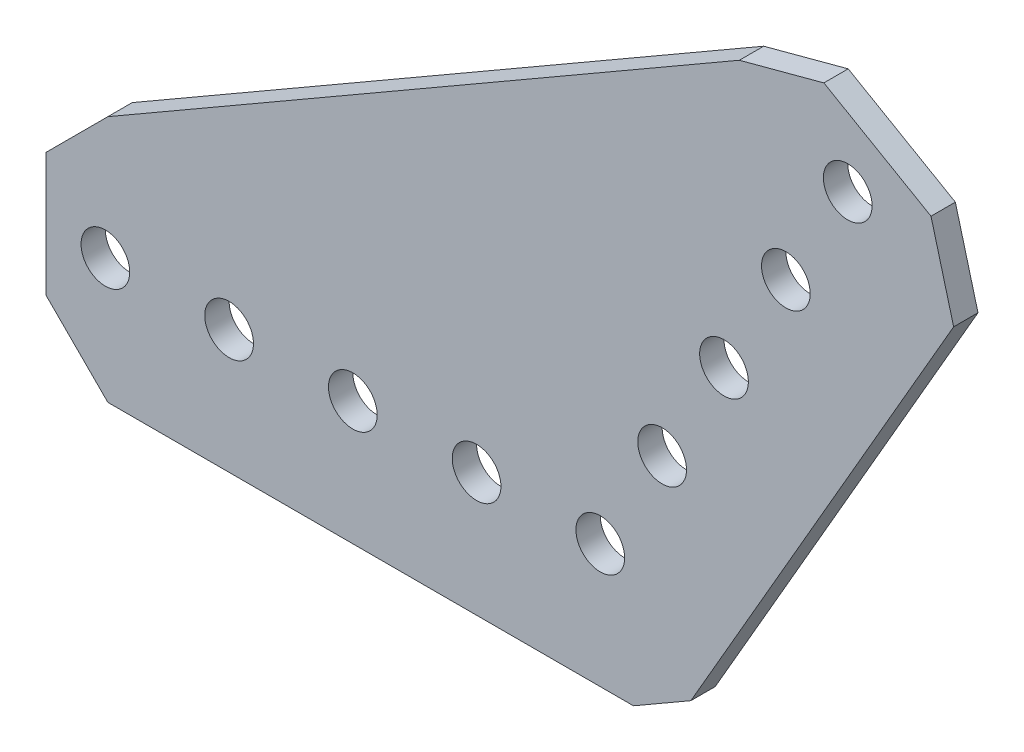
ISO-10303-21;
HEADER;
FILE_DESCRIPTION(('STEP AP214'),'2;1');
FILE_NAME('part.step','',(''),(''),'','','');
FILE_SCHEMA(('AUTOMOTIVE_DESIGN { 1 0 10303 214 1 1 1 1 }'));
ENDSEC;
DATA;
#1=APPLICATION_CONTEXT('core data for automotive mechanical design processes');
#2=APPLICATION_PROTOCOL_DEFINITION('international standard','automotive_design',2000,#1);
#3=PRODUCT_CONTEXT('',#1,'mechanical');
#4=PRODUCT('Part','Part','',(#3));
#5=PRODUCT_RELATED_PRODUCT_CATEGORY('part','',(#4));
#6=PRODUCT_DEFINITION_FORMATION('','',#4);
#7=PRODUCT_DEFINITION_CONTEXT('part definition',#1,'design');
#8=PRODUCT_DEFINITION('design','',#6,#7);
#9=PRODUCT_DEFINITION_SHAPE('','',#8);
#10=(LENGTH_UNIT() NAMED_UNIT(*) SI_UNIT(.MILLI.,.METRE.));
#11=(NAMED_UNIT(*) PLANE_ANGLE_UNIT() SI_UNIT($,.RADIAN.));
#12=(NAMED_UNIT(*) SI_UNIT($,.STERADIAN.) SOLID_ANGLE_UNIT());
#13=UNCERTAINTY_MEASURE_WITH_UNIT(LENGTH_MEASURE(1.E-05),#10,'distance_accuracy_value','');
#14=(GEOMETRIC_REPRESENTATION_CONTEXT(3) GLOBAL_UNCERTAINTY_ASSIGNED_CONTEXT((#13)) GLOBAL_UNIT_ASSIGNED_CONTEXT((#10,
#11,#12)) REPRESENTATION_CONTEXT('',''));
#15=CARTESIAN_POINT('',(0.,0.,0.));
#16=DIRECTION('',(0.,0.,1.));
#17=DIRECTION('',(1.,0.,0.));
#18=AXIS2_PLACEMENT_3D('',#15,#16,#17);
#19=CARTESIAN_POINT('',(9.29704525612477,-9.29704525612472,1.25));
#20=DIRECTION('',(0.500000000000001,-0.866025403784438,0.));
#21=DIRECTION('',(0.866025403784438,0.500000000000001,0.));
#22=AXIS2_PLACEMENT_3D('',#19,#20,#21);
#23=PLANE('',#22);
#24=DIRECTION('',(-0.866025403784438,-0.500000000000001,0.));
#25=VECTOR('',#24,1.);
#26=CARTESIAN_POINT('',(9.29704525612477,-9.29704525612472,-1.25));
#27=LINE('',#26,#25);
#28=CARTESIAN_POINT('',(9.29704525612477,-9.29704525612472,-1.25));
#29=VERTEX_POINT('',#28);
#30=CARTESIAN_POINT('',(3.40295474387527,-12.7,-1.25));
#31=VERTEX_POINT('',#30);
#32=EDGE_CURVE('E160',#29,#31,#27,.T.);
#33=ORIENTED_EDGE('',*,*,#32,.F.);
#34=DIRECTION('',(0.,0.,-1.));
#35=VECTOR('',#34,1.);
#36=CARTESIAN_POINT('',(9.29704525612477,-9.29704525612472,1.25));
#37=LINE('',#36,#35);
#38=CARTESIAN_POINT('',(9.29704525612477,-9.29704525612472,1.25));
#39=VERTEX_POINT('',#38);
#40=EDGE_CURVE('E11',#39,#29,#37,.T.);
#41=ORIENTED_EDGE('',*,*,#40,.F.);
#42=DIRECTION('',(-0.866025403784438,-0.500000000000001,0.));
#43=VECTOR('',#42,1.);
#44=CARTESIAN_POINT('',(9.29704525612477,-9.29704525612472,1.25));
#45=LINE('',#44,#43);
#46=CARTESIAN_POINT('',(3.40295474387527,-12.7,1.25));
#47=VERTEX_POINT('',#46);
#48=EDGE_CURVE('E197',#39,#47,#45,.T.);
#49=ORIENTED_EDGE('',*,*,#48,.T.);
#50=DIRECTION('',(0.,0.,-1.));
#51=VECTOR('',#50,1.);
#52=CARTESIAN_POINT('',(3.40295474387527,-12.7,1.25));
#53=LINE('',#52,#51);
#54=EDGE_CURVE('E48',#47,#31,#53,.T.);
#55=ORIENTED_EDGE('',*,*,#54,.T.);
#56=EDGE_LOOP('',(#33,#41,#49,#55));
#57=FACE_BOUND('',#56,.T.);
#58=ADVANCED_FACE('F45',(#57),#23,.T.);
#59=CARTESIAN_POINT('',(36.2715226280623,37.4241200596883,1.25));
#60=DIRECTION('',(0.86602540378444,-0.499999999999998,0.));
#61=DIRECTION('',(0.499999999999998,0.86602540378444,0.));
#62=AXIS2_PLACEMENT_3D('',#59,#60,#61);
#63=PLANE('',#62);
#64=DIRECTION('',(-0.499999999999998,-0.86602540378444,0.));
#65=VECTOR('',#64,1.);
#66=CARTESIAN_POINT('',(36.2715226280623,37.4241200596883,-1.25));
#67=LINE('',#66,#65);
#68=CARTESIAN_POINT('',(36.2715226280623,37.4241200596883,-1.25));
#69=VERTEX_POINT('',#68);
#70=EDGE_CURVE('E194',#69,#29,#67,.T.);
#71=ORIENTED_EDGE('',*,*,#70,.F.);
#72=DIRECTION('',(0.,0.,-1.));
#73=VECTOR('',#72,1.);
#74=CARTESIAN_POINT('',(36.2715226280623,37.4241200596883,1.25));
#75=LINE('',#74,#73);
#76=CARTESIAN_POINT('',(36.2715226280623,37.4241200596883,1.25));
#77=VERTEX_POINT('',#76);
#78=EDGE_CURVE('E55',#77,#69,#75,.T.);
#79=ORIENTED_EDGE('',*,*,#78,.F.);
#80=DIRECTION('',(-0.499999999999998,-0.86602540378444,0.));
#81=VECTOR('',#80,1.);
#82=CARTESIAN_POINT('',(36.2715226280623,37.4241200596883,1.25));
#83=LINE('',#82,#81);
#84=EDGE_CURVE('E146',#77,#39,#83,.T.);
#85=ORIENTED_EDGE('',*,*,#84,.T.);
#86=ORIENTED_EDGE('',*,*,#40,.T.);
#87=EDGE_LOOP('',(#71,#79,#85,#86));
#88=FACE_BOUND('',#87,.T.);
#89=ADVANCED_FACE('F221',(#88),#63,.T.);
#90=CARTESIAN_POINT('',(33.9472613140311,46.0983813737195,1.25));
#91=DIRECTION('',(0.965925826289068,0.258819045102522,0.));
#92=DIRECTION('',(-0.258819045102522,0.965925826289068,0.));
#93=AXIS2_PLACEMENT_3D('',#90,#91,#92);
#94=PLANE('',#93);
#95=DIRECTION('',(0.258819045102522,-0.965925826289068,0.));
#96=VECTOR('',#95,1.);
#97=CARTESIAN_POINT('',(33.9472613140311,46.0983813737195,-1.25));
#98=LINE('',#97,#96);
#99=CARTESIAN_POINT('',(33.9472613140311,46.0983813737195,-1.25));
#100=VERTEX_POINT('',#99);
#101=EDGE_CURVE('E132',#100,#69,#98,.T.);
#102=ORIENTED_EDGE('',*,*,#101,.F.);
#103=DIRECTION('',(0.,0.,-1.));
#104=VECTOR('',#103,1.);
#105=CARTESIAN_POINT('',(33.9472613140311,46.0983813737195,1.25));
#106=LINE('',#105,#104);
#107=CARTESIAN_POINT('',(33.9472613140311,46.0983813737195,1.25));
#108=VERTEX_POINT('',#107);
#109=EDGE_CURVE('E127',#108,#100,#106,.T.);
#110=ORIENTED_EDGE('',*,*,#109,.F.);
#111=DIRECTION('',(0.258819045102522,-0.965925826289068,0.));
#112=VECTOR('',#111,1.);
#113=CARTESIAN_POINT('',(33.9472613140311,46.0983813737195,1.25));
#114=LINE('',#113,#112);
#115=EDGE_CURVE('E130',#108,#77,#114,.T.);
#116=ORIENTED_EDGE('',*,*,#115,.T.);
#117=ORIENTED_EDGE('',*,*,#78,.T.);
#118=EDGE_LOOP('',(#102,#110,#116,#117));
#119=FACE_BOUND('',#118,.T.);
#120=ADVANCED_FACE('F129',(#119),#94,.T.);
#121=CARTESIAN_POINT('',(22.9487386859687,52.4483813737195,1.25));
#122=DIRECTION('',(0.500000000000001,0.866025403784438,0.));
#123=DIRECTION('',(-0.866025403784438,0.500000000000001,0.));
#124=AXIS2_PLACEMENT_3D('',#121,#122,#123);
#125=PLANE('',#124);
#126=DIRECTION('',(0.866025403784438,-0.500000000000001,0.));
#127=VECTOR('',#126,1.);
#128=CARTESIAN_POINT('',(22.9487386859687,52.4483813737195,-1.25));
#129=LINE('',#128,#127);
#130=CARTESIAN_POINT('',(22.9487386859687,52.4483813737195,-1.25));
#131=VERTEX_POINT('',#130);
#132=EDGE_CURVE('E189',#131,#100,#129,.T.);
#133=ORIENTED_EDGE('',*,*,#132,.F.);
#134=DIRECTION('',(0.,0.,-1.));
#135=VECTOR('',#134,1.);
#136=CARTESIAN_POINT('',(22.9487386859687,52.4483813737195,1.25));
#137=LINE('',#136,#135);
#138=CARTESIAN_POINT('',(22.9487386859687,52.4483813737195,1.25));
#139=VERTEX_POINT('',#138);
#140=EDGE_CURVE('E138',#139,#131,#137,.T.);
#141=ORIENTED_EDGE('',*,*,#140,.F.);
#142=DIRECTION('',(0.866025403784438,-0.500000000000001,0.));
#143=VECTOR('',#142,1.);
#144=CARTESIAN_POINT('',(22.9487386859687,52.4483813737195,1.25));
#145=LINE('',#144,#143);
#146=EDGE_CURVE('E144',#139,#108,#145,.T.);
#147=ORIENTED_EDGE('',*,*,#146,.T.);
#148=ORIENTED_EDGE('',*,*,#109,.T.);
#149=EDGE_LOOP('',(#133,#141,#147,#148));
#150=FACE_BOUND('',#149,.T.);
#151=ADVANCED_FACE('F149',(#150),#125,.T.);
#152=CARTESIAN_POINT('',(14.2744773719375,50.1241200596883,1.25));
#153=DIRECTION('',(-0.25881904510252,0.965925826289069,0.));
#154=DIRECTION('',(-0.965925826289069,-0.25881904510252,0.));
#155=AXIS2_PLACEMENT_3D('',#152,#153,#154);
#156=PLANE('',#155);
#157=DIRECTION('',(0.965925826289068,0.25881904510252,0.));
#158=VECTOR('',#157,1.);
#159=CARTESIAN_POINT('',(14.2744773719375,50.1241200596883,-1.25));
#160=LINE('',#159,#158);
#161=CARTESIAN_POINT('',(14.2744773719375,50.1241200596883,-1.25));
#162=VERTEX_POINT('',#161);
#163=EDGE_CURVE('E185',#162,#131,#160,.T.);
#164=ORIENTED_EDGE('',*,*,#163,.F.);
#165=DIRECTION('',(0.,0.,-1.));
#166=VECTOR('',#165,1.);
#167=CARTESIAN_POINT('',(14.2744773719375,50.1241200596883,1.25));
#168=LINE('',#167,#166);
#169=CARTESIAN_POINT('',(14.2744773719375,50.1241200596883,1.25));
#170=VERTEX_POINT('',#169);
#171=EDGE_CURVE('E203',#170,#162,#168,.T.);
#172=ORIENTED_EDGE('',*,*,#171,.F.);
#173=DIRECTION('',(0.965925826289068,0.25881904510252,0.));
#174=VECTOR('',#173,1.);
#175=CARTESIAN_POINT('',(14.2744773719375,50.1241200596883,1.25));
#176=LINE('',#175,#174);
#177=EDGE_CURVE('E151',#170,#139,#176,.T.);
#178=ORIENTED_EDGE('',*,*,#177,.T.);
#179=ORIENTED_EDGE('',*,*,#140,.T.);
#180=EDGE_LOOP('',(#164,#172,#178,#179));
#181=FACE_BOUND('',#180,.T.);
#182=ADVANCED_FACE('F234',(#181),#156,.T.);
#183=CARTESIAN_POINT('',(-50.546,12.7,1.25));
#184=DIRECTION('',(-0.500000000000001,0.866025403784438,0.));
#185=DIRECTION('',(-0.866025403784438,-0.500000000000001,0.));
#186=AXIS2_PLACEMENT_3D('',#183,#184,#185);
#187=PLANE('',#186);
#188=DIRECTION('',(0.866025403784438,0.500000000000001,0.));
#189=VECTOR('',#188,1.);
#190=CARTESIAN_POINT('',(-50.546,12.7,-1.25));
#191=LINE('',#190,#189);
#192=CARTESIAN_POINT('',(-50.546,12.7,-1.25));
#193=VERTEX_POINT('',#192);
#194=EDGE_CURVE('E181',#193,#162,#191,.T.);
#195=ORIENTED_EDGE('',*,*,#194,.F.);
#196=DIRECTION('',(0.,0.,-1.));
#197=VECTOR('',#196,1.);
#198=CARTESIAN_POINT('',(-50.546,12.7,1.25));
#199=LINE('',#198,#197);
#200=CARTESIAN_POINT('',(-50.546,12.7,1.25));
#201=VERTEX_POINT('',#200);
#202=EDGE_CURVE('E206',#201,#193,#199,.T.);
#203=ORIENTED_EDGE('',*,*,#202,.F.);
#204=DIRECTION('',(0.866025403784438,0.500000000000001,0.));
#205=VECTOR('',#204,1.);
#206=CARTESIAN_POINT('',(-50.546,12.7,1.25));
#207=LINE('',#206,#205);
#208=EDGE_CURVE('E154',#201,#170,#207,.T.);
#209=ORIENTED_EDGE('',*,*,#208,.T.);
#210=ORIENTED_EDGE('',*,*,#171,.T.);
#211=EDGE_LOOP('',(#195,#203,#209,#210));
#212=FACE_BOUND('',#211,.T.);
#213=ADVANCED_FACE('F237',(#212),#187,.T.);
#214=CARTESIAN_POINT('',(-56.896,6.35,1.25));
#215=DIRECTION('',(-0.707106781186547,0.707106781186548,0.));
#216=DIRECTION('',(-0.707106781186548,-0.707106781186547,0.));
#217=AXIS2_PLACEMENT_3D('',#214,#215,#216);
#218=PLANE('',#217);
#219=DIRECTION('',(0.707106781186548,0.707106781186547,0.));
#220=VECTOR('',#219,1.);
#221=CARTESIAN_POINT('',(-56.896,6.35,-1.25));
#222=LINE('',#221,#220);
#223=CARTESIAN_POINT('',(-56.896,6.35,-1.25));
#224=VERTEX_POINT('',#223);
#225=EDGE_CURVE('E177',#224,#193,#222,.T.);
#226=ORIENTED_EDGE('',*,*,#225,.F.);
#227=DIRECTION('',(0.,0.,-1.));
#228=VECTOR('',#227,1.);
#229=CARTESIAN_POINT('',(-56.896,6.35,1.25));
#230=LINE('',#229,#228);
#231=CARTESIAN_POINT('',(-56.896,6.35,1.25));
#232=VERTEX_POINT('',#231);
#233=EDGE_CURVE('E209',#232,#224,#230,.T.);
#234=ORIENTED_EDGE('',*,*,#233,.F.);
#235=DIRECTION('',(0.707106781186548,0.707106781186547,0.));
#236=VECTOR('',#235,1.);
#237=CARTESIAN_POINT('',(-56.896,6.35,1.25));
#238=LINE('',#237,#236);
#239=EDGE_CURVE('E389',#232,#201,#238,.T.);
#240=ORIENTED_EDGE('',*,*,#239,.T.);
#241=ORIENTED_EDGE('',*,*,#202,.T.);
#242=EDGE_LOOP('',(#226,#234,#240,#241));
#243=FACE_BOUND('',#242,.T.);
#244=ADVANCED_FACE('F241',(#243),#218,.T.);
#245=CARTESIAN_POINT('',(-56.896,-6.35,1.25));
#246=DIRECTION('',(-1.,0.,0.));
#247=DIRECTION('',(0.,0.,1.));
#248=AXIS2_PLACEMENT_3D('',#245,#246,#247);
#249=PLANE('',#248);
#250=DIRECTION('',(0.,1.,0.));
#251=VECTOR('',#250,1.);
#252=CARTESIAN_POINT('',(-56.896,-6.35,-1.25));
#253=LINE('',#252,#251);
#254=CARTESIAN_POINT('',(-56.896,-6.35,-1.25));
#255=VERTEX_POINT('',#254);
#256=EDGE_CURVE('E173',#255,#224,#253,.T.);
#257=ORIENTED_EDGE('',*,*,#256,.F.);
#258=DIRECTION('',(0.,0.,-1.));
#259=VECTOR('',#258,1.);
#260=CARTESIAN_POINT('',(-56.896,-6.35,1.25));
#261=LINE('',#260,#259);
#262=CARTESIAN_POINT('',(-56.896,-6.35,1.25));
#263=VERTEX_POINT('',#262);
#264=EDGE_CURVE('E212',#263,#255,#261,.T.);
#265=ORIENTED_EDGE('',*,*,#264,.F.);
#266=DIRECTION('',(0.,1.,0.));
#267=VECTOR('',#266,1.);
#268=CARTESIAN_POINT('',(-56.896,-6.35,1.25));
#269=LINE('',#268,#267);
#270=EDGE_CURVE('E385',#263,#232,#269,.T.);
#271=ORIENTED_EDGE('',*,*,#270,.T.);
#272=ORIENTED_EDGE('',*,*,#233,.T.);
#273=EDGE_LOOP('',(#257,#265,#271,#272));
#274=FACE_BOUND('',#273,.T.);
#275=ADVANCED_FACE('F245',(#274),#249,.T.);
#276=CARTESIAN_POINT('',(-50.546,-12.7,1.25));
#277=DIRECTION('',(-0.707106781186547,-0.707106781186548,0.));
#278=DIRECTION('',(0.707106781186548,-0.707106781186547,0.));
#279=AXIS2_PLACEMENT_3D('',#276,#277,#278);
#280=PLANE('',#279);
#281=DIRECTION('',(-0.707106781186548,0.707106781186547,0.));
#282=VECTOR('',#281,1.);
#283=CARTESIAN_POINT('',(-50.546,-12.7,-1.25));
#284=LINE('',#283,#282);
#285=CARTESIAN_POINT('',(-50.546,-12.7,-1.25));
#286=VERTEX_POINT('',#285);
#287=EDGE_CURVE('E169',#286,#255,#284,.T.);
#288=ORIENTED_EDGE('',*,*,#287,.F.);
#289=DIRECTION('',(0.,0.,-1.));
#290=VECTOR('',#289,1.);
#291=CARTESIAN_POINT('',(-50.546,-12.7,1.25));
#292=LINE('',#291,#290);
#293=CARTESIAN_POINT('',(-50.546,-12.7,1.25));
#294=VERTEX_POINT('',#293);
#295=EDGE_CURVE('E214',#294,#286,#292,.T.);
#296=ORIENTED_EDGE('',*,*,#295,.F.);
#297=DIRECTION('',(-0.707106781186548,0.707106781186547,0.));
#298=VECTOR('',#297,1.);
#299=CARTESIAN_POINT('',(-50.546,-12.7,1.25));
#300=LINE('',#299,#298);
#301=EDGE_CURVE('E381',#294,#263,#300,.T.);
#302=ORIENTED_EDGE('',*,*,#301,.T.);
#303=ORIENTED_EDGE('',*,*,#264,.T.);
#304=EDGE_LOOP('',(#288,#296,#302,#303));
#305=FACE_BOUND('',#304,.T.);
#306=ADVANCED_FACE('F249',(#305),#280,.T.);
#307=CARTESIAN_POINT('',(3.40295474387527,-12.7,1.25));
#308=DIRECTION('',(0.,-1.,0.));
#309=DIRECTION('',(0.,0.,-1.));
#310=AXIS2_PLACEMENT_3D('',#307,#308,#309);
#311=PLANE('',#310);
#312=DIRECTION('',(-1.,0.,0.));
#313=VECTOR('',#312,1.);
#314=CARTESIAN_POINT('',(3.40295474387527,-12.7,-1.25));
#315=LINE('',#314,#313);
#316=EDGE_CURVE('E164',#31,#286,#315,.T.);
#317=ORIENTED_EDGE('',*,*,#316,.F.);
#318=ORIENTED_EDGE('',*,*,#54,.F.);
#319=DIRECTION('',(-1.,0.,0.));
#320=VECTOR('',#319,1.);
#321=CARTESIAN_POINT('',(3.40295474387527,-12.7,1.25));
#322=LINE('',#321,#320);
#323=EDGE_CURVE('E378',#47,#294,#322,.T.);
#324=ORIENTED_EDGE('',*,*,#323,.T.);
#325=ORIENTED_EDGE('',*,*,#295,.T.);
#326=EDGE_LOOP('',(#317,#318,#324,#325));
#327=FACE_BOUND('',#326,.T.);
#328=ADVANCED_FACE('F218',(#327),#311,.T.);
#329=CARTESIAN_POINT('',(0.,0.,1.25));
#330=DIRECTION('',(0.,0.,-1.));
#331=DIRECTION('',(-1.,0.,0.));
#332=AXIS2_PLACEMENT_3D('',#329,#330,#331);
#333=PLANE('',#332);
#334=CARTESIAN_POINT('',(6.35000000000007,10.9985226280623,1.25));
#335=DIRECTION('',(0.,0.,-1.));
#336=DIRECTION('',(1.,0.,0.));
#337=AXIS2_PLACEMENT_3D('',#334,#335,#336);
#338=CIRCLE('',#337,2.5);
#339=CARTESIAN_POINT('',(8.85000000000007,10.9985226280623,1.25));
#340=VERTEX_POINT('',#339);
#341=EDGE_CURVE('E304',#340,#340,#338,.T.);
#342=ORIENTED_EDGE('',*,*,#341,.T.);
#343=EDGE_LOOP('',(#342));
#344=FACE_BOUND('',#343,.T.);
#345=CARTESIAN_POINT('',(12.7,21.9970452561247,1.25));
#346=DIRECTION('',(0.,0.,-1.));
#347=DIRECTION('',(1.,0.,0.));
#348=AXIS2_PLACEMENT_3D('',#345,#346,#347);
#349=CIRCLE('',#348,2.5);
#350=CARTESIAN_POINT('',(15.2,21.9970452561247,1.25));
#351=VERTEX_POINT('',#350);
#352=EDGE_CURVE('E314',#351,#351,#349,.T.);
#353=ORIENTED_EDGE('',*,*,#352,.T.);
#354=EDGE_LOOP('',(#353));
#355=FACE_BOUND('',#354,.T.);
#356=CARTESIAN_POINT('',(19.05,32.9955678841871,1.25));
#357=DIRECTION('',(0.,0.,-1.));
#358=DIRECTION('',(1.,0.,0.));
#359=AXIS2_PLACEMENT_3D('',#356,#357,#358);
#360=CIRCLE('',#359,2.5);
#361=CARTESIAN_POINT('',(21.55,32.9955678841871,1.25));
#362=VERTEX_POINT('',#361);
#363=EDGE_CURVE('E322',#362,#362,#360,.T.);
#364=ORIENTED_EDGE('',*,*,#363,.T.);
#365=EDGE_LOOP('',(#364));
#366=FACE_BOUND('',#365,.T.);
#367=CARTESIAN_POINT('',(25.4,43.9940905122495,1.25));
#368=DIRECTION('',(0.,0.,-1.));
#369=DIRECTION('',(1.,0.,0.));
#370=AXIS2_PLACEMENT_3D('',#367,#368,#369);
#371=CIRCLE('',#370,2.5);
#372=CARTESIAN_POINT('',(27.9,43.9940905122495,1.25));
#373=VERTEX_POINT('',#372);
#374=EDGE_CURVE('E330',#373,#373,#371,.T.);
#375=ORIENTED_EDGE('',*,*,#374,.T.);
#376=EDGE_LOOP('',(#375));
#377=FACE_BOUND('',#376,.T.);
#378=CARTESIAN_POINT('',(-38.1,0.,1.25));
#379=DIRECTION('',(0.,0.,-1.));
#380=DIRECTION('',(1.,0.,0.));
#381=AXIS2_PLACEMENT_3D('',#378,#379,#380);
#382=CIRCLE('',#381,2.5);
#383=CARTESIAN_POINT('',(-35.6,0.,1.25));
#384=VERTEX_POINT('',#383);
#385=EDGE_CURVE('E338',#384,#384,#382,.T.);
#386=ORIENTED_EDGE('',*,*,#385,.T.);
#387=EDGE_LOOP('',(#386));
#388=FACE_BOUND('',#387,.T.);
#389=CARTESIAN_POINT('',(-50.8,0.,1.25));
#390=DIRECTION('',(0.,0.,-1.));
#391=DIRECTION('',(1.,0.,0.));
#392=AXIS2_PLACEMENT_3D('',#389,#390,#391);
#393=CIRCLE('',#392,2.5);
#394=CARTESIAN_POINT('',(-48.3,0.,1.25));
#395=VERTEX_POINT('',#394);
#396=EDGE_CURVE('E346',#395,#395,#393,.T.);
#397=ORIENTED_EDGE('',*,*,#396,.T.);
#398=EDGE_LOOP('',(#397));
#399=FACE_BOUND('',#398,.T.);
#400=CARTESIAN_POINT('',(0.,0.,1.25));
#401=DIRECTION('',(0.,0.,-1.));
#402=DIRECTION('',(1.,0.,0.));
#403=AXIS2_PLACEMENT_3D('',#400,#401,#402);
#404=CIRCLE('',#403,2.5);
#405=CARTESIAN_POINT('',(2.5,0.,1.25));
#406=VERTEX_POINT('',#405);
#407=EDGE_CURVE('E354',#406,#406,#404,.T.);
#408=ORIENTED_EDGE('',*,*,#407,.T.);
#409=EDGE_LOOP('',(#408));
#410=FACE_BOUND('',#409,.T.);
#411=CARTESIAN_POINT('',(-25.4,0.,1.25));
#412=DIRECTION('',(0.,0.,-1.));
#413=DIRECTION('',(1.,0.,0.));
#414=AXIS2_PLACEMENT_3D('',#411,#412,#413);
#415=CIRCLE('',#414,2.5);
#416=CARTESIAN_POINT('',(-22.9,0.,1.25));
#417=VERTEX_POINT('',#416);
#418=EDGE_CURVE('E362',#417,#417,#415,.T.);
#419=ORIENTED_EDGE('',*,*,#418,.T.);
#420=EDGE_LOOP('',(#419));
#421=FACE_BOUND('',#420,.T.);
#422=CARTESIAN_POINT('',(-12.7,0.,1.25));
#423=DIRECTION('',(0.,0.,-1.));
#424=DIRECTION('',(1.,0.,0.));
#425=AXIS2_PLACEMENT_3D('',#422,#423,#424);
#426=CIRCLE('',#425,2.5);
#427=CARTESIAN_POINT('',(-10.2,0.,1.25));
#428=VERTEX_POINT('',#427);
#429=EDGE_CURVE('E165',#428,#428,#426,.T.);
#430=ORIENTED_EDGE('',*,*,#429,.T.);
#431=EDGE_LOOP('',(#430));
#432=FACE_BOUND('',#431,.T.);
#433=ORIENTED_EDGE('',*,*,#48,.F.);
#434=ORIENTED_EDGE('',*,*,#84,.F.);
#435=ORIENTED_EDGE('',*,*,#115,.F.);
#436=ORIENTED_EDGE('',*,*,#146,.F.);
#437=ORIENTED_EDGE('',*,*,#177,.F.);
#438=ORIENTED_EDGE('',*,*,#208,.F.);
#439=ORIENTED_EDGE('',*,*,#239,.F.);
#440=ORIENTED_EDGE('',*,*,#270,.F.);
#441=ORIENTED_EDGE('',*,*,#301,.F.);
#442=ORIENTED_EDGE('',*,*,#323,.F.);
#443=EDGE_LOOP('',(#433,#434,#435,#436,#437,#438,#439,#440,#441,#442));
#444=FACE_BOUND('',#443,.T.);
#445=ADVANCED_FACE('F142',(#344,#355,#366,#377,#388,#399,#410,#421,#432,#444),#333,.F.);
#446=CARTESIAN_POINT('',(0.,0.,-1.25));
#447=DIRECTION('',(0.,0.,-1.));
#448=DIRECTION('',(-1.,0.,0.));
#449=AXIS2_PLACEMENT_3D('',#446,#447,#448);
#450=PLANE('',#449);
#451=CARTESIAN_POINT('',(6.35000000000007,10.9985226280623,-1.25));
#452=DIRECTION('',(0.,0.,-1.));
#453=DIRECTION('',(1.,0.,0.));
#454=AXIS2_PLACEMENT_3D('',#451,#452,#453);
#455=CIRCLE('',#454,2.5);
#456=CARTESIAN_POINT('',(8.85000000000007,10.9985226280623,-1.25));
#457=VERTEX_POINT('',#456);
#458=EDGE_CURVE('E307',#457,#457,#455,.T.);
#459=ORIENTED_EDGE('',*,*,#458,.F.);
#460=EDGE_LOOP('',(#459));
#461=FACE_BOUND('',#460,.T.);
#462=CARTESIAN_POINT('',(12.7,21.9970452561247,-1.25));
#463=DIRECTION('',(0.,0.,-1.));
#464=DIRECTION('',(1.,0.,0.));
#465=AXIS2_PLACEMENT_3D('',#462,#463,#464);
#466=CIRCLE('',#465,2.5);
#467=CARTESIAN_POINT('',(15.2,21.9970452561247,-1.25));
#468=VERTEX_POINT('',#467);
#469=EDGE_CURVE('E311',#468,#468,#466,.T.);
#470=ORIENTED_EDGE('',*,*,#469,.F.);
#471=EDGE_LOOP('',(#470));
#472=FACE_BOUND('',#471,.T.);
#473=CARTESIAN_POINT('',(19.05,32.9955678841871,-1.25));
#474=DIRECTION('',(0.,0.,-1.));
#475=DIRECTION('',(1.,0.,0.));
#476=AXIS2_PLACEMENT_3D('',#473,#474,#475);
#477=CIRCLE('',#476,2.5);
#478=CARTESIAN_POINT('',(21.55,32.9955678841871,-1.25));
#479=VERTEX_POINT('',#478);
#480=EDGE_CURVE('E318',#479,#479,#477,.T.);
#481=ORIENTED_EDGE('',*,*,#480,.F.);
#482=EDGE_LOOP('',(#481));
#483=FACE_BOUND('',#482,.T.);
#484=CARTESIAN_POINT('',(25.4,43.9940905122495,-1.25));
#485=DIRECTION('',(0.,0.,-1.));
#486=DIRECTION('',(1.,0.,0.));
#487=AXIS2_PLACEMENT_3D('',#484,#485,#486);
#488=CIRCLE('',#487,2.5);
#489=CARTESIAN_POINT('',(27.9,43.9940905122495,-1.25));
#490=VERTEX_POINT('',#489);
#491=EDGE_CURVE('E326',#490,#490,#488,.T.);
#492=ORIENTED_EDGE('',*,*,#491,.F.);
#493=EDGE_LOOP('',(#492));
#494=FACE_BOUND('',#493,.T.);
#495=CARTESIAN_POINT('',(-38.1,0.,-1.25));
#496=DIRECTION('',(0.,0.,-1.));
#497=DIRECTION('',(1.,0.,0.));
#498=AXIS2_PLACEMENT_3D('',#495,#496,#497);
#499=CIRCLE('',#498,2.5);
#500=CARTESIAN_POINT('',(-35.6,0.,-1.25));
#501=VERTEX_POINT('',#500);
#502=EDGE_CURVE('E334',#501,#501,#499,.T.);
#503=ORIENTED_EDGE('',*,*,#502,.F.);
#504=EDGE_LOOP('',(#503));
#505=FACE_BOUND('',#504,.T.);
#506=CARTESIAN_POINT('',(-50.8,0.,-1.25));
#507=DIRECTION('',(0.,0.,-1.));
#508=DIRECTION('',(1.,0.,0.));
#509=AXIS2_PLACEMENT_3D('',#506,#507,#508);
#510=CIRCLE('',#509,2.5);
#511=CARTESIAN_POINT('',(-48.3,0.,-1.25));
#512=VERTEX_POINT('',#511);
#513=EDGE_CURVE('E342',#512,#512,#510,.T.);
#514=ORIENTED_EDGE('',*,*,#513,.F.);
#515=EDGE_LOOP('',(#514));
#516=FACE_BOUND('',#515,.T.);
#517=CARTESIAN_POINT('',(0.,0.,-1.25));
#518=DIRECTION('',(0.,0.,-1.));
#519=DIRECTION('',(1.,0.,0.));
#520=AXIS2_PLACEMENT_3D('',#517,#518,#519);
#521=CIRCLE('',#520,2.5);
#522=CARTESIAN_POINT('',(2.5,0.,-1.25));
#523=VERTEX_POINT('',#522);
#524=EDGE_CURVE('E350',#523,#523,#521,.T.);
#525=ORIENTED_EDGE('',*,*,#524,.F.);
#526=EDGE_LOOP('',(#525));
#527=FACE_BOUND('',#526,.T.);
#528=CARTESIAN_POINT('',(-25.4,0.,-1.25));
#529=DIRECTION('',(0.,0.,-1.));
#530=DIRECTION('',(1.,0.,0.));
#531=AXIS2_PLACEMENT_3D('',#528,#529,#530);
#532=CIRCLE('',#531,2.5);
#533=CARTESIAN_POINT('',(-22.9,0.,-1.25));
#534=VERTEX_POINT('',#533);
#535=EDGE_CURVE('E358',#534,#534,#532,.T.);
#536=ORIENTED_EDGE('',*,*,#535,.F.);
#537=EDGE_LOOP('',(#536));
#538=FACE_BOUND('',#537,.T.);
#539=CARTESIAN_POINT('',(-12.7,0.,-1.25));
#540=DIRECTION('',(0.,0.,-1.));
#541=DIRECTION('',(1.,0.,0.));
#542=AXIS2_PLACEMENT_3D('',#539,#540,#541);
#543=CIRCLE('',#542,2.5);
#544=CARTESIAN_POINT('',(-10.2,0.,-1.25));
#545=VERTEX_POINT('',#544);
#546=EDGE_CURVE('E366',#545,#545,#543,.T.);
#547=ORIENTED_EDGE('',*,*,#546,.F.);
#548=EDGE_LOOP('',(#547));
#549=FACE_BOUND('',#548,.T.);
#550=ORIENTED_EDGE('',*,*,#32,.T.);
#551=ORIENTED_EDGE('',*,*,#316,.T.);
#552=ORIENTED_EDGE('',*,*,#287,.T.);
#553=ORIENTED_EDGE('',*,*,#256,.T.);
#554=ORIENTED_EDGE('',*,*,#225,.T.);
#555=ORIENTED_EDGE('',*,*,#194,.T.);
#556=ORIENTED_EDGE('',*,*,#163,.T.);
#557=ORIENTED_EDGE('',*,*,#132,.T.);
#558=ORIENTED_EDGE('',*,*,#101,.T.);
#559=ORIENTED_EDGE('',*,*,#70,.T.);
#560=EDGE_LOOP('',(#550,#551,#552,#553,#554,#555,#556,#557,#558,#559));
#561=FACE_BOUND('',#560,.T.);
#562=ADVANCED_FACE('F220',(#461,#472,#483,#494,#505,#516,#527,#538,#549,#561),#450,.T.);
#563=CARTESIAN_POINT('',(-12.7,0.,1.25));
#564=DIRECTION('',(0.,0.,-1.));
#565=DIRECTION('',(-1.,0.,0.));
#566=AXIS2_PLACEMENT_3D('',#563,#564,#565);
#567=CYLINDRICAL_SURFACE('',#566,2.5);
#568=ORIENTED_EDGE('',*,*,#429,.F.);
#569=EDGE_LOOP('',(#568));
#570=FACE_BOUND('',#569,.T.);
#571=ORIENTED_EDGE('',*,*,#546,.T.);
#572=EDGE_LOOP('',(#571));
#573=FACE_BOUND('',#572,.T.);
#574=ADVANCED_FACE('F261',(#570,#573),#567,.F.);
#575=CARTESIAN_POINT('',(-25.4,0.,1.25));
#576=DIRECTION('',(0.,0.,-1.));
#577=DIRECTION('',(-1.,0.,0.));
#578=AXIS2_PLACEMENT_3D('',#575,#576,#577);
#579=CYLINDRICAL_SURFACE('',#578,2.5);
#580=ORIENTED_EDGE('',*,*,#418,.F.);
#581=EDGE_LOOP('',(#580));
#582=FACE_BOUND('',#581,.T.);
#583=ORIENTED_EDGE('',*,*,#535,.T.);
#584=EDGE_LOOP('',(#583));
#585=FACE_BOUND('',#584,.T.);
#586=ADVANCED_FACE('F268',(#582,#585),#579,.F.);
#587=CARTESIAN_POINT('',(0.,0.,1.25));
#588=DIRECTION('',(0.,0.,-1.));
#589=DIRECTION('',(-1.,0.,0.));
#590=AXIS2_PLACEMENT_3D('',#587,#588,#589);
#591=CYLINDRICAL_SURFACE('',#590,2.5);
#592=ORIENTED_EDGE('',*,*,#407,.F.);
#593=EDGE_LOOP('',(#592));
#594=FACE_BOUND('',#593,.T.);
#595=ORIENTED_EDGE('',*,*,#524,.T.);
#596=EDGE_LOOP('',(#595));
#597=FACE_BOUND('',#596,.T.);
#598=ADVANCED_FACE('F272',(#594,#597),#591,.F.);
#599=CARTESIAN_POINT('',(-50.8,0.,1.25));
#600=DIRECTION('',(0.,0.,-1.));
#601=DIRECTION('',(-1.,0.,0.));
#602=AXIS2_PLACEMENT_3D('',#599,#600,#601);
#603=CYLINDRICAL_SURFACE('',#602,2.5);
#604=ORIENTED_EDGE('',*,*,#396,.F.);
#605=EDGE_LOOP('',(#604));
#606=FACE_BOUND('',#605,.T.);
#607=ORIENTED_EDGE('',*,*,#513,.T.);
#608=EDGE_LOOP('',(#607));
#609=FACE_BOUND('',#608,.T.);
#610=ADVANCED_FACE('F276',(#606,#609),#603,.F.);
#611=CARTESIAN_POINT('',(-38.1,0.,1.25));
#612=DIRECTION('',(0.,0.,-1.));
#613=DIRECTION('',(-1.,0.,0.));
#614=AXIS2_PLACEMENT_3D('',#611,#612,#613);
#615=CYLINDRICAL_SURFACE('',#614,2.5);
#616=ORIENTED_EDGE('',*,*,#385,.F.);
#617=EDGE_LOOP('',(#616));
#618=FACE_BOUND('',#617,.T.);
#619=ORIENTED_EDGE('',*,*,#502,.T.);
#620=EDGE_LOOP('',(#619));
#621=FACE_BOUND('',#620,.T.);
#622=ADVANCED_FACE('F280',(#618,#621),#615,.F.);
#623=CARTESIAN_POINT('',(25.4,43.9940905122495,1.25));
#624=DIRECTION('',(0.,0.,-1.));
#625=DIRECTION('',(-1.,0.,0.));
#626=AXIS2_PLACEMENT_3D('',#623,#624,#625);
#627=CYLINDRICAL_SURFACE('',#626,2.5);
#628=ORIENTED_EDGE('',*,*,#374,.F.);
#629=EDGE_LOOP('',(#628));
#630=FACE_BOUND('',#629,.T.);
#631=ORIENTED_EDGE('',*,*,#491,.T.);
#632=EDGE_LOOP('',(#631));
#633=FACE_BOUND('',#632,.T.);
#634=ADVANCED_FACE('F284',(#630,#633),#627,.F.);
#635=CARTESIAN_POINT('',(19.05,32.9955678841871,1.25));
#636=DIRECTION('',(0.,0.,-1.));
#637=DIRECTION('',(-1.,0.,0.));
#638=AXIS2_PLACEMENT_3D('',#635,#636,#637);
#639=CYLINDRICAL_SURFACE('',#638,2.5);
#640=ORIENTED_EDGE('',*,*,#363,.F.);
#641=EDGE_LOOP('',(#640));
#642=FACE_BOUND('',#641,.T.);
#643=ORIENTED_EDGE('',*,*,#480,.T.);
#644=EDGE_LOOP('',(#643));
#645=FACE_BOUND('',#644,.T.);
#646=ADVANCED_FACE('F288',(#642,#645),#639,.F.);
#647=CARTESIAN_POINT('',(12.7,21.9970452561247,1.25));
#648=DIRECTION('',(0.,0.,-1.));
#649=DIRECTION('',(-1.,0.,0.));
#650=AXIS2_PLACEMENT_3D('',#647,#648,#649);
#651=CYLINDRICAL_SURFACE('',#650,2.5);
#652=ORIENTED_EDGE('',*,*,#352,.F.);
#653=EDGE_LOOP('',(#652));
#654=FACE_BOUND('',#653,.T.);
#655=ORIENTED_EDGE('',*,*,#469,.T.);
#656=EDGE_LOOP('',(#655));
#657=FACE_BOUND('',#656,.T.);
#658=ADVANCED_FACE('F292',(#654,#657),#651,.F.);
#659=CARTESIAN_POINT('',(6.35000000000007,10.9985226280623,1.25));
#660=DIRECTION('',(0.,0.,-1.));
#661=DIRECTION('',(-1.,0.,0.));
#662=AXIS2_PLACEMENT_3D('',#659,#660,#661);
#663=CYLINDRICAL_SURFACE('',#662,2.5);
#664=ORIENTED_EDGE('',*,*,#341,.F.);
#665=EDGE_LOOP('',(#664));
#666=FACE_BOUND('',#665,.T.);
#667=ORIENTED_EDGE('',*,*,#458,.T.);
#668=EDGE_LOOP('',(#667));
#669=FACE_BOUND('',#668,.T.);
#670=ADVANCED_FACE('F296',(#666,#669),#663,.F.);
#671=CLOSED_SHELL('',(#58,#89,#120,#151,#182,#213,#244,#275,#306,#328,#445,#562,#574,#586,#598,
#610,#622,#634,#646,#658,#670));
#672=MANIFOLD_SOLID_BREP('B2',#671);
#673=ADVANCED_BREP_SHAPE_REPRESENTATION('',(#18,#672),#14);
#674=SHAPE_DEFINITION_REPRESENTATION(#9,#673);
ENDSEC;
END-ISO-10303-21;
